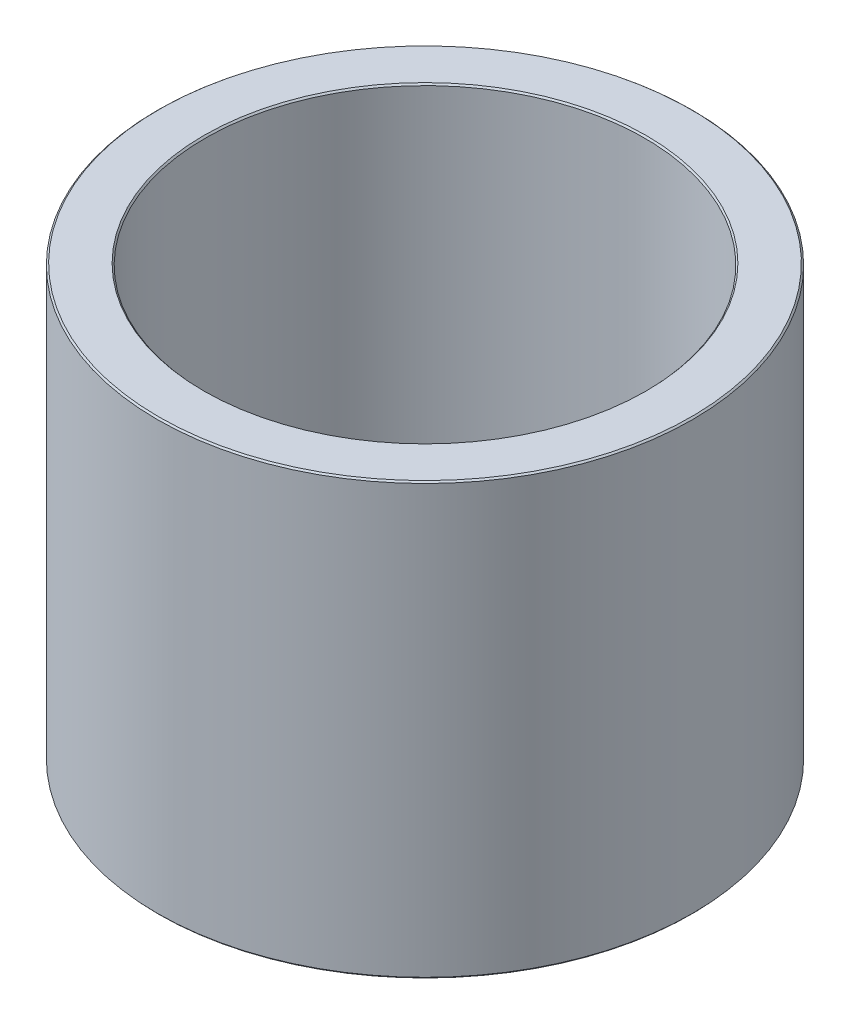
ISO-10303-21;
HEADER;
FILE_DESCRIPTION(('STEP AP214'),'2;1');
FILE_NAME('part.step','',(''),(''),'','','');
FILE_SCHEMA(('AUTOMOTIVE_DESIGN { 1 0 10303 214 1 1 1 1 }'));
ENDSEC;
DATA;
#1=APPLICATION_CONTEXT('core data for automotive mechanical design processes');
#2=APPLICATION_PROTOCOL_DEFINITION('international standard','automotive_design',2000,#1);
#3=PRODUCT_CONTEXT('',#1,'mechanical');
#4=PRODUCT('Part','Part','',(#3));
#5=PRODUCT_RELATED_PRODUCT_CATEGORY('part','',(#4));
#6=PRODUCT_DEFINITION_FORMATION('','',#4);
#7=PRODUCT_DEFINITION_CONTEXT('part definition',#1,'design');
#8=PRODUCT_DEFINITION('design','',#6,#7);
#9=PRODUCT_DEFINITION_SHAPE('','',#8);
#10=(LENGTH_UNIT() NAMED_UNIT(*) SI_UNIT(.MILLI.,.METRE.));
#11=(NAMED_UNIT(*) PLANE_ANGLE_UNIT() SI_UNIT($,.RADIAN.));
#12=(NAMED_UNIT(*) SI_UNIT($,.STERADIAN.) SOLID_ANGLE_UNIT());
#13=UNCERTAINTY_MEASURE_WITH_UNIT(LENGTH_MEASURE(1.E-05),#10,'distance_accuracy_value','');
#14=(GEOMETRIC_REPRESENTATION_CONTEXT(3) GLOBAL_UNCERTAINTY_ASSIGNED_CONTEXT((#13)) GLOBAL_UNIT_ASSIGNED_CONTEXT((#10,
#11,#12)) REPRESENTATION_CONTEXT('',''));
#15=CARTESIAN_POINT('',(0.,0.,0.));
#16=DIRECTION('',(0.,0.,1.));
#17=DIRECTION('',(1.,0.,0.));
#18=AXIS2_PLACEMENT_3D('',#15,#16,#17);
#19=CARTESIAN_POINT('',(0.,76.4070101380797,0.));
#20=DIRECTION('',(0.,-1.,0.));
#21=DIRECTION('',(0.,0.,-1.));
#22=AXIS2_PLACEMENT_3D('',#19,#20,#21);
#23=CYLINDRICAL_SURFACE('',#22,47.5);
#24=CARTESIAN_POINT('',(0.,0.280808559016257,0.));
#25=DIRECTION('',(0.,1.,0.));
#26=DIRECTION('',(0.,0.,1.));
#27=AXIS2_PLACEMENT_3D('',#24,#25,#26);
#28=CIRCLE('',#27,47.5);
#29=CARTESIAN_POINT('',(0.,0.280808559016257,47.5));
#30=VERTEX_POINT('',#29);
#31=EDGE_CURVE('E10',#30,#30,#28,.T.);
#32=ORIENTED_EDGE('',*,*,#31,.T.);
#33=EDGE_LOOP('',(#32));
#34=FACE_BOUND('',#33,.T.);
#35=CARTESIAN_POINT('',(0.,76.15117848706,0.));
#36=DIRECTION('',(0.,1.,0.));
#37=DIRECTION('',(0.,0.,1.));
#38=AXIS2_PLACEMENT_3D('',#35,#36,#37);
#39=CIRCLE('',#38,47.5);
#40=CARTESIAN_POINT('',(0.,76.15117848706,47.5));
#41=VERTEX_POINT('',#40);
#42=EDGE_CURVE('E50',#41,#41,#39,.F.);
#43=ORIENTED_EDGE('',*,*,#42,.T.);
#44=EDGE_LOOP('',(#43));
#45=FACE_BOUND('',#44,.T.);
#46=ADVANCED_FACE('F39',(#34,#45),#23,.T.);
#47=CARTESIAN_POINT('',(0.,76.4070101380797,0.));
#48=DIRECTION('',(0.,1.,0.));
#49=DIRECTION('',(0.,0.,1.));
#50=AXIS2_PLACEMENT_3D('',#47,#48,#49);
#51=PLANE('',#50);
#52=CARTESIAN_POINT('',(0.,76.4070101380797,0.));
#53=DIRECTION('',(0.,1.,0.));
#54=DIRECTION('',(0.,0.,1.));
#55=AXIS2_PLACEMENT_3D('',#52,#53,#54);
#56=CIRCLE('',#55,39.2525329207198);
#57=CARTESIAN_POINT('',(0.,76.4070101380797,39.2525329207198));
#58=VERTEX_POINT('',#57);
#59=EDGE_CURVE('E58',#58,#58,#56,.F.);
#60=ORIENTED_EDGE('',*,*,#59,.T.);
#61=EDGE_LOOP('',(#60));
#62=FACE_BOUND('',#61,.T.);
#63=CARTESIAN_POINT('',(0.,76.4070101380797,0.));
#64=DIRECTION('',(0.,1.,0.));
#65=DIRECTION('',(0.,0.,1.));
#66=AXIS2_PLACEMENT_3D('',#63,#64,#65);
#67=CIRCLE('',#66,47.2191914409837);
#68=CARTESIAN_POINT('',(0.,76.4070101380797,47.2191914409837));
#69=VERTEX_POINT('',#68);
#70=EDGE_CURVE('E61',#69,#69,#67,.T.);
#71=ORIENTED_EDGE('',*,*,#70,.T.);
#72=EDGE_LOOP('',(#71));
#73=FACE_BOUND('',#72,.T.);
#74=ADVANCED_FACE('F88',(#62,#73),#51,.T.);
#75=CARTESIAN_POINT('',(0.,0.,0.));
#76=DIRECTION('',(0.,1.,0.));
#77=DIRECTION('',(0.,0.,1.));
#78=AXIS2_PLACEMENT_3D('',#75,#76,#77);
#79=PLANE('',#78);
#80=CARTESIAN_POINT('',(0.,0.,0.));
#81=DIRECTION('',(0.,1.,0.));
#82=DIRECTION('',(0.,0.,1.));
#83=AXIS2_PLACEMENT_3D('',#80,#81,#82);
#84=CIRCLE('',#83,39.2775098287164);
#85=CARTESIAN_POINT('',(0.,0.,39.2775098287164));
#86=VERTEX_POINT('',#85);
#87=EDGE_CURVE('E51',#86,#86,#84,.T.);
#88=ORIENTED_EDGE('',*,*,#87,.T.);
#89=EDGE_LOOP('',(#88));
#90=FACE_BOUND('',#89,.T.);
#91=CARTESIAN_POINT('',(0.,0.,0.));
#92=DIRECTION('',(0.,1.,0.));
#93=DIRECTION('',(0.,0.,1.));
#94=AXIS2_PLACEMENT_3D('',#91,#92,#93);
#95=CIRCLE('',#94,47.2441683489803);
#96=CARTESIAN_POINT('',(0.,0.,47.2441683489803));
#97=VERTEX_POINT('',#96);
#98=EDGE_CURVE('E54',#97,#97,#95,.F.);
#99=ORIENTED_EDGE('',*,*,#98,.T.);
#100=EDGE_LOOP('',(#99));
#101=FACE_BOUND('',#100,.T.);
#102=ADVANCED_FACE('F83',(#90,#101),#79,.F.);
#103=CARTESIAN_POINT('',(0.,76.4070101380797,0.));
#104=DIRECTION('',(0.,-1.,0.));
#105=DIRECTION('',(0.,0.,-1.));
#106=AXIS2_PLACEMENT_3D('',#103,#104,#105);
#107=CYLINDRICAL_SURFACE('',#106,38.9967012697001);
#108=CARTESIAN_POINT('',(0.,76.1262015790634,0.));
#109=DIRECTION('',(0.,1.,0.));
#110=DIRECTION('',(0.,0.,1.));
#111=AXIS2_PLACEMENT_3D('',#108,#109,#110);
#112=CIRCLE('',#111,38.9967012697001);
#113=CARTESIAN_POINT('',(0.,76.1262015790634,38.9967012697001));
#114=VERTEX_POINT('',#113);
#115=EDGE_CURVE('E67',#114,#114,#112,.T.);
#116=ORIENTED_EDGE('',*,*,#115,.T.);
#117=EDGE_LOOP('',(#116));
#118=FACE_BOUND('',#117,.T.);
#119=CARTESIAN_POINT('',(0.,0.255831651019722,0.));
#120=DIRECTION('',(0.,1.,0.));
#121=DIRECTION('',(0.,0.,1.));
#122=AXIS2_PLACEMENT_3D('',#119,#120,#121);
#123=CIRCLE('',#122,38.9967012697001);
#124=CARTESIAN_POINT('',(0.,0.255831651019722,38.9967012697001));
#125=VERTEX_POINT('',#124);
#126=EDGE_CURVE('E69',#125,#125,#123,.F.);
#127=ORIENTED_EDGE('',*,*,#126,.T.);
#128=EDGE_LOOP('',(#127));
#129=FACE_BOUND('',#128,.T.);
#130=ADVANCED_FACE('F71',(#118,#129),#107,.F.);
#131=CARTESIAN_POINT('',(0.,76.1262015790634,0.));
#132=DIRECTION('',(0.,1.,0.));
#133=DIRECTION('',(0.,0.,1.));
#134=AXIS2_PLACEMENT_3D('',#131,#132,#133);
#135=CONICAL_SURFACE('',#134,38.9967012697001,0.73888861113365);
#136=CARTESIAN_POINT('',(0.,76.4070101380797,39.2525329207198));
#137=CARTESIAN_POINT('',(0.,76.4040850489232,39.2498680076884));
#138=CARTESIAN_POINT('',(0.,76.4011599597668,39.2472030946569));
#139=CARTESIAN_POINT('',(0.,76.395309781454,39.241873268594));
#140=CARTESIAN_POINT('',(0.,76.3923846922976,39.2392083555625));
#141=CARTESIAN_POINT('',(0.,76.3865345139847,39.2338785294996));
#142=CARTESIAN_POINT('',(0.,76.3836094248283,39.2312136164682));
#143=CARTESIAN_POINT('',(0.,76.3777592465155,39.2258837904053));
#144=CARTESIAN_POINT('',(0.,76.374834157359,39.2232188773738));
#145=CARTESIAN_POINT('',(0.,76.3689839790462,39.2178890513109));
#146=CARTESIAN_POINT('',(0.,76.3660588898898,39.2152241382794));
#147=CARTESIAN_POINT('',(0.,76.3602087115769,39.2098943122165));
#148=CARTESIAN_POINT('',(0.,76.3572836224205,39.2072293991851));
#149=CARTESIAN_POINT('',(0.,76.3514334441077,39.2018995731222));
#150=CARTESIAN_POINT('',(0.,76.3485083549513,39.1992346600907));
#151=CARTESIAN_POINT('',(0.,76.3426581766384,39.1939048340278));
#152=CARTESIAN_POINT('',(0.,76.339733087482,39.1912399209963));
#153=CARTESIAN_POINT('',(0.,76.3338829091692,39.1859100949334));
#154=CARTESIAN_POINT('',(0.,76.3309578200127,39.183245181902));
#155=CARTESIAN_POINT('',(0.,76.3251076416999,39.1779153558391));
#156=CARTESIAN_POINT('',(0.,76.3221825525435,39.1752504428076));
#157=CARTESIAN_POINT('',(0.,76.3163323742306,39.1699206167447));
#158=CARTESIAN_POINT('',(0.,76.3134072850742,39.1672557037132));
#159=CARTESIAN_POINT('',(0.,76.3075571067614,39.1619258776503));
#160=CARTESIAN_POINT('',(0.,76.304632017605,39.1592609646189));
#161=CARTESIAN_POINT('',(0.,76.2987818392921,39.153931138556));
#162=CARTESIAN_POINT('',(0.,76.2958567501357,39.1512662255245));
#163=CARTESIAN_POINT('',(0.,76.2900065718229,39.1459363994616));
#164=CARTESIAN_POINT('',(0.,76.2870814826665,39.1432714864301));
#165=CARTESIAN_POINT('',(0.,76.2812313043536,39.1379416603672));
#166=CARTESIAN_POINT('',(0.,76.2783062151972,39.1352767473358));
#167=CARTESIAN_POINT('',(0.,76.2724560368844,39.1299469212729));
#168=CARTESIAN_POINT('',(0.,76.2695309477279,39.1272820082414));
#169=CARTESIAN_POINT('',(0.,76.2636807694151,39.1219521821785));
#170=CARTESIAN_POINT('',(0.,76.2607556802587,39.119287269147));
#171=CARTESIAN_POINT('',(0.,76.2549055019458,39.1139574430841));
#172=CARTESIAN_POINT('',(0.,76.2519804127894,39.1112925300527));
#173=CARTESIAN_POINT('',(0.,76.2461302344766,39.1059627039898));
#174=CARTESIAN_POINT('',(0.,76.2432051453201,39.1032977909583));
#175=CARTESIAN_POINT('',(0.,76.2373549670073,39.0979679648954));
#176=CARTESIAN_POINT('',(0.,76.2344298778509,39.0953030518639));
#177=CARTESIAN_POINT('',(0.,76.2285796995381,39.089973225801));
#178=CARTESIAN_POINT('',(0.,76.2256546103816,39.0873083127696));
#179=CARTESIAN_POINT('',(0.,76.2198044320688,39.0819784867067));
#180=CARTESIAN_POINT('',(0.,76.2168793429124,39.0793135736752));
#181=CARTESIAN_POINT('',(0.,76.2110291645995,39.0739837476123));
#182=CARTESIAN_POINT('',(0.,76.2081040754431,39.0713188345808));
#183=CARTESIAN_POINT('',(0.,76.2022538971303,39.0659890085179));
#184=CARTESIAN_POINT('',(0.,76.1993288079739,39.0633240954865));
#185=CARTESIAN_POINT('',(0.,76.193478629661,39.0579942694236));
#186=CARTESIAN_POINT('',(0.,76.1905535405046,39.0553293563921));
#187=CARTESIAN_POINT('',(0.,76.1847033621918,39.0499995303292));
#188=CARTESIAN_POINT('',(0.,76.1817782730353,39.0473346172977));
#189=CARTESIAN_POINT('',(0.,76.1759280947225,39.0420047912348));
#190=CARTESIAN_POINT('',(0.,76.1730030055661,39.0393398782034));
#191=CARTESIAN_POINT('',(0.,76.1671528272532,39.0340100521405));
#192=CARTESIAN_POINT('',(0.,76.1642277380968,39.031345139109));
#193=CARTESIAN_POINT('',(0.,76.158377559784,39.0260153130461));
#194=CARTESIAN_POINT('',(0.,76.1554524706276,39.0233504000146));
#195=CARTESIAN_POINT('',(0.,76.1496022923147,39.0180205739517));
#196=CARTESIAN_POINT('',(0.,76.1466772031583,39.0153556609203));
#197=CARTESIAN_POINT('',(0.,76.1408270248455,39.0100258348574));
#198=CARTESIAN_POINT('',(0.,76.137901935689,39.0073609218259));
#199=CARTESIAN_POINT('',(0.,76.1320517573762,39.002031095763));
#200=CARTESIAN_POINT('',(0.,76.1291266682198,38.9993661827315));
#201=CARTESIAN_POINT('',(0.,76.1262015790634,38.9967012697001));
#202=B_SPLINE_CURVE_WITH_KNOTS('',3,(#136,#137,#138,#139,#140,#141,#142,#143,#144,#145,#146,
#147,#148,#149,#150,#151,#152,#153,#154,#155,#156,#157,#158,#159,#160,#161,#162,#163,#164,#165,
#166,#167,#168,#169,#170,#171,#172,#173,#174,#175,#176,#177,#178,#179,#180,#181,#182,#183,#184,
#185,#186,#187,#188,#189,#190,#191,#192,#193,#194,#195,#196,#197,#198,#199,#200,#201),
.UNSPECIFIED.,.F.,.F.,(4,2,2,2,2,2,2,2,2,2,2,2,2,2,2,2,2,2,2,2,2,2,2,2,2,2,2,2,2,2,2,2,4),(0.,
0.0118710223799066,0.023742044759803,0.0356130671396993,0.0474840895195957,0.059355111899492,
0.0712261342793884,0.0830971566592847,0.0949681790391811,0.106839201419088,0.118710223798989,
0.130581246178885,0.142452268558781,0.154323290938678,0.166194313318574,0.17806533569847,
0.189936358078367,0.201807380458273,0.21367840283817,0.225549425218066,0.237420447597962,
0.249291469977859,0.261162492357755,0.273033514737651,0.284904537117548,0.296775559497454,
0.308646581877355,0.320517604257252,0.332388626637148,0.344259649017045,0.356130671396941,
0.368001693776837,0.379872716156733),.UNSPECIFIED.);
#203=EDGE_CURVE('BSEAM77',#58,#114,#202,.T.);
#204=ORIENTED_EDGE('',*,*,#59,.F.);
#205=ORIENTED_EDGE('',*,*,#115,.F.);
#206=ORIENTED_EDGE('',*,*,#203,.T.);
#207=ORIENTED_EDGE('',*,*,#203,.F.);
#208=EDGE_LOOP('',(#204,#206,#205,#207));
#209=FACE_BOUND('',#208,.T.);
#210=ADVANCED_FACE('F77',(#209),#135,.F.);
#211=CARTESIAN_POINT('',(0.,0.,0.));
#212=DIRECTION('',(0.,-1.,0.));
#213=DIRECTION('',(0.,0.,-1.));
#214=AXIS2_PLACEMENT_3D('',#211,#212,#213);
#215=CONICAL_SURFACE('',#214,39.2775098287164,0.831907715661224);
#216=ORIENTED_EDGE('',*,*,#126,.F.);
#217=EDGE_LOOP('',(#216));
#218=FACE_BOUND('',#217,.T.);
#219=ORIENTED_EDGE('',*,*,#87,.F.);
#220=EDGE_LOOP('',(#219));
#221=FACE_BOUND('',#220,.T.);
#222=ADVANCED_FACE('F73',(#218,#221),#215,.F.);
#223=CARTESIAN_POINT('',(0.,0.280808559016257,0.));
#224=DIRECTION('',(0.,1.,0.));
#225=DIRECTION('',(0.,0.,1.));
#226=AXIS2_PLACEMENT_3D('',#223,#224,#225);
#227=CONICAL_SURFACE('',#226,47.5,0.738888611133684);
#228=ORIENTED_EDGE('',*,*,#98,.F.);
#229=EDGE_LOOP('',(#228));
#230=FACE_BOUND('',#229,.T.);
#231=ORIENTED_EDGE('',*,*,#31,.F.);
#232=EDGE_LOOP('',(#231));
#233=FACE_BOUND('',#232,.T.);
#234=ADVANCED_FACE('F76',(#230,#233),#227,.T.);
#235=CARTESIAN_POINT('',(0.,76.4070101380797,0.));
#236=DIRECTION('',(0.,-1.,0.));
#237=DIRECTION('',(0.,0.,-1.));
#238=AXIS2_PLACEMENT_3D('',#235,#236,#237);
#239=CONICAL_SURFACE('',#238,47.2191914409837,0.831907715661261);
#240=ORIENTED_EDGE('',*,*,#42,.F.);
#241=EDGE_LOOP('',(#240));
#242=FACE_BOUND('',#241,.T.);
#243=ORIENTED_EDGE('',*,*,#70,.F.);
#244=EDGE_LOOP('',(#243));
#245=FACE_BOUND('',#244,.T.);
#246=ADVANCED_FACE('F45',(#242,#245),#239,.T.);
#247=CLOSED_SHELL('',(#46,#74,#102,#130,#210,#222,#234,#246));
#248=MANIFOLD_SOLID_BREP('B2',#247);
#249=ADVANCED_BREP_SHAPE_REPRESENTATION('',(#18,#248),#14);
#250=SHAPE_DEFINITION_REPRESENTATION(#9,#249);
ENDSEC;
END-ISO-10303-21;
